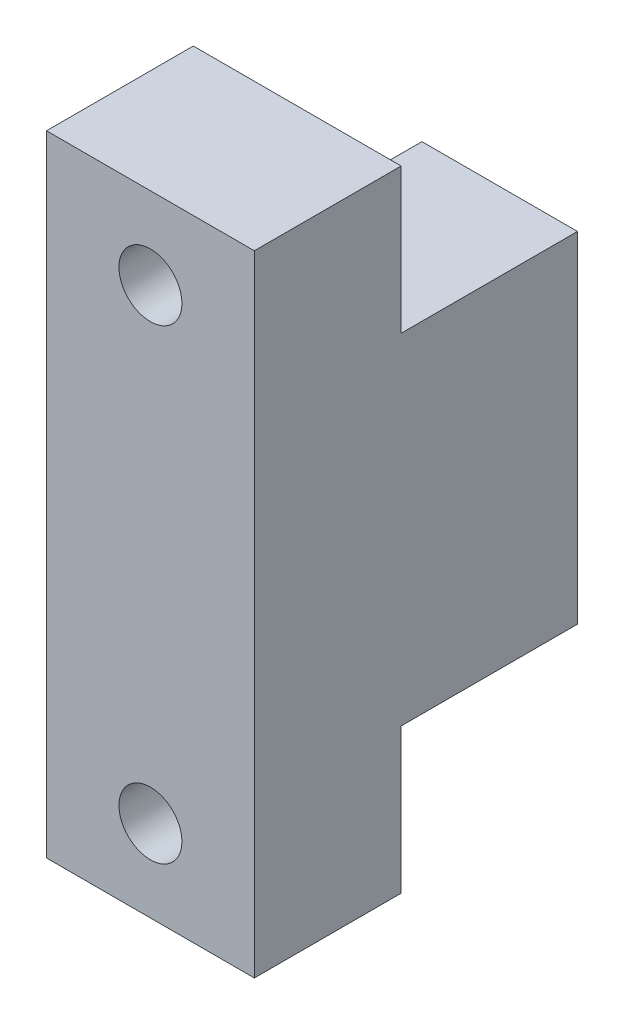
ISO-10303-21;
HEADER;
FILE_DESCRIPTION(('STEP AP214'),'2;1');
FILE_NAME('part.step','',(''),(''),'','','');
FILE_SCHEMA(('AUTOMOTIVE_DESIGN { 1 0 10303 214 1 1 1 1 }'));
ENDSEC;
DATA;
#1=APPLICATION_CONTEXT('core data for automotive mechanical design processes');
#2=APPLICATION_PROTOCOL_DEFINITION('international standard','automotive_design',2000,#1);
#3=PRODUCT_CONTEXT('',#1,'mechanical');
#4=PRODUCT('Part','Part','',(#3));
#5=PRODUCT_RELATED_PRODUCT_CATEGORY('part','',(#4));
#6=PRODUCT_DEFINITION_FORMATION('','',#4);
#7=PRODUCT_DEFINITION_CONTEXT('part definition',#1,'design');
#8=PRODUCT_DEFINITION('design','',#6,#7);
#9=PRODUCT_DEFINITION_SHAPE('','',#8);
#10=(LENGTH_UNIT() NAMED_UNIT(*) SI_UNIT(.MILLI.,.METRE.));
#11=(NAMED_UNIT(*) PLANE_ANGLE_UNIT() SI_UNIT($,.RADIAN.));
#12=(NAMED_UNIT(*) SI_UNIT($,.STERADIAN.) SOLID_ANGLE_UNIT());
#13=UNCERTAINTY_MEASURE_WITH_UNIT(LENGTH_MEASURE(1.E-05),#10,'distance_accuracy_value','');
#14=(GEOMETRIC_REPRESENTATION_CONTEXT(3) GLOBAL_UNCERTAINTY_ASSIGNED_CONTEXT((#13)) GLOBAL_UNIT_ASSIGNED_CONTEXT((#10,
#11,#12)) REPRESENTATION_CONTEXT('',''));
#15=CARTESIAN_POINT('',(0.,0.,0.));
#16=DIRECTION('',(0.,0.,1.));
#17=DIRECTION('',(1.,0.,0.));
#18=AXIS2_PLACEMENT_3D('',#15,#16,#17);
#19=CARTESIAN_POINT('',(-2.60427187106552,9.90671661729943,-5.99999999999804));
#20=DIRECTION('',(0.,0.,1.));
#21=DIRECTION('',(-1.,0.,0.));
#22=AXIS2_PLACEMENT_3D('',#19,#20,#21);
#23=PLANE('',#22);
#24=CARTESIAN_POINT('',(-2.72378881314441,17.9067153880362,-5.99999999999806));
#25=DIRECTION('',(0.,0.,1.));
#26=DIRECTION('',(1.,0.,0.));
#27=AXIS2_PLACEMENT_3D('',#24,#25,#26);
#28=CIRCLE('',#27,3.1);
#29=CARTESIAN_POINT('',(0.376211186855589,17.9067153880362,-5.99999999999808));
#30=VERTEX_POINT('',#29);
#31=EDGE_CURVE('E344',#30,#30,#28,.T.);
#32=ORIENTED_EDGE('',*,*,#31,.T.);
#33=EDGE_LOOP('',(#32));
#34=FACE_BOUND('',#33,.T.);
#35=CARTESIAN_POINT('',(-2.72378881314433,1.90671538803624,-5.99999999999801));
#36=DIRECTION('',(0.,0.,1.));
#37=DIRECTION('',(1.,0.,0.));
#38=AXIS2_PLACEMENT_3D('',#35,#36,#37);
#39=CIRCLE('',#38,3.1);
#40=CARTESIAN_POINT('',(0.376211186855676,1.90671538803624,-5.99999999999803));
#41=VERTEX_POINT('',#40);
#42=EDGE_CURVE('E51',#41,#41,#39,.T.);
#43=ORIENTED_EDGE('',*,*,#42,.T.);
#44=EDGE_LOOP('',(#43));
#45=FACE_BOUND('',#44,.T.);
#46=DIRECTION('',(-1.,0.,0.));
#47=VECTOR('',#46,1.);
#48=CARTESIAN_POINT('',(-2.72378881314444,21.8067153880362,-5.99999999999807));
#49=LINE('',#48,#47);
#50=CARTESIAN_POINT('',(-2.72378881314444,21.8067153880362,-5.99999999999807));
#51=VERTEX_POINT('',#50);
#52=CARTESIAN_POINT('',(-6.82378881314439,21.8067153880362,-5.99999999999805));
#53=VERTEX_POINT('',#52);
#54=EDGE_CURVE('E58',#51,#53,#49,.T.);
#55=ORIENTED_EDGE('',*,*,#54,.F.);
#56=CARTESIAN_POINT('',(-2.72378881314442,17.9067153880362,-5.99999999999806));
#57=DIRECTION('',(0.,0.,1.));
#58=DIRECTION('',(-1.,0.,0.));
#59=AXIS2_PLACEMENT_3D('',#56,#57,#58);
#60=CIRCLE('',#59,3.9);
#61=CARTESIAN_POINT('',(1.17621118685558,17.9067153880363,-5.99999999999809));
#62=VERTEX_POINT('',#61);
#63=EDGE_CURVE('E62',#62,#51,#60,.T.);
#64=ORIENTED_EDGE('',*,*,#63,.F.);
#65=DIRECTION('',(0.,1.,0.));
#66=VECTOR('',#65,1.);
#67=CARTESIAN_POINT('',(1.17621118685566,1.90671538803626,-5.99999999999804));
#68=LINE('',#67,#66);
#69=CARTESIAN_POINT('',(1.17621118685566,1.90671538803626,-5.99999999999804));
#70=VERTEX_POINT('',#69);
#71=EDGE_CURVE('E208',#70,#62,#68,.T.);
#72=ORIENTED_EDGE('',*,*,#71,.F.);
#73=CARTESIAN_POINT('',(-2.72378881314434,1.90671538803624,-5.99999999999801));
#74=DIRECTION('',(0.,0.,1.));
#75=DIRECTION('',(-1.,0.,0.));
#76=AXIS2_PLACEMENT_3D('',#73,#74,#75);
#77=CIRCLE('',#76,3.9);
#78=CARTESIAN_POINT('',(-2.72378881314431,-1.99328461196376,-5.999999999998));
#79=VERTEX_POINT('',#78);
#80=EDGE_CURVE('E204',#79,#70,#77,.T.);
#81=ORIENTED_EDGE('',*,*,#80,.F.);
#82=DIRECTION('',(1.,0.,0.));
#83=VECTOR('',#82,1.);
#84=CARTESIAN_POINT('',(-6.82378881314428,-1.99328461196379,-5.99999999999797));
#85=LINE('',#84,#83);
#86=CARTESIAN_POINT('',(-6.82378881314428,-1.99328461196378,-5.99999999999797));
#87=VERTEX_POINT('',#86);
#88=EDGE_CURVE('E200',#87,#79,#85,.T.);
#89=ORIENTED_EDGE('',*,*,#88,.F.);
#90=DIRECTION('',(0.,-1.,0.));
#91=VECTOR('',#90,1.);
#92=CARTESIAN_POINT('',(-6.82378881314427,-3.59328461196373,-5.99999999999797));
#93=LINE('',#92,#91);
#94=EDGE_CURVE('E245',#53,#87,#93,.T.);
#95=ORIENTED_EDGE('',*,*,#94,.F.);
#96=EDGE_LOOP('',(#55,#64,#72,#81,#89,#95));
#97=FACE_BOUND('',#96,.T.);
#98=ADVANCED_FACE('F41',(#34,#45,#97),#23,.F.);
#99=CARTESIAN_POINT('',(0.,0.,0.));
#100=DIRECTION('',(0.,0.,1.));
#101=DIRECTION('',(1.,0.,0.));
#102=AXIS2_PLACEMENT_3D('',#99,#100,#101);
#103=PLANE('',#102);
#104=CARTESIAN_POINT('',(-2.72378881314441,28.4067153880389,0.));
#105=DIRECTION('',(0.,0.,1.));
#106=DIRECTION('',(1.,0.,0.));
#107=AXIS2_PLACEMENT_3D('',#104,#105,#106);
#108=CIRCLE('',#107,4.5);
#109=CARTESIAN_POINT('',(1.77621118685559,28.4067153880389,0.));
#110=VERTEX_POINT('',#109);
#111=EDGE_CURVE('E334',#110,#110,#108,.T.);
#112=ORIENTED_EDGE('',*,*,#111,.T.);
#113=EDGE_LOOP('',(#112));
#114=FACE_BOUND('',#113,.T.);
#115=CARTESIAN_POINT('',(-2.72378881314433,-8.59328461196111,0.));
#116=DIRECTION('',(0.,0.,1.));
#117=DIRECTION('',(1.,0.,0.));
#118=AXIS2_PLACEMENT_3D('',#115,#116,#117);
#119=CIRCLE('',#118,4.5);
#120=CARTESIAN_POINT('',(1.77621118685567,-8.59328461196111,0.));
#121=VERTEX_POINT('',#120);
#122=EDGE_CURVE('E281',#121,#121,#119,.T.);
#123=ORIENTED_EDGE('',*,*,#122,.T.);
#124=EDGE_LOOP('',(#123));
#125=FACE_BOUND('',#124,.T.);
#126=DIRECTION('',(-1.,0.,0.));
#127=VECTOR('',#126,1.);
#128=CARTESIAN_POINT('',(-6.82378881314427,-3.59328461196382,0.));
#129=LINE('',#128,#127);
#130=CARTESIAN_POINT('',(5.52621118685907,-3.59328461196382,0.));
#131=VERTEX_POINT('',#130);
#132=CARTESIAN_POINT('',(-6.82378881314427,-3.59328461196382,0.));
#133=VERTEX_POINT('',#132);
#134=EDGE_CURVE('E258',#131,#133,#129,.T.);
#135=ORIENTED_EDGE('',*,*,#134,.F.);
#136=DIRECTION('',(0.,1.,0.));
#137=VECTOR('',#136,1.);
#138=CARTESIAN_POINT('',(5.52621118685907,-15.0932846119611,0.));
#139=LINE('',#138,#137);
#140=CARTESIAN_POINT('',(5.52621118685907,-15.0932846119611,0.));
#141=VERTEX_POINT('',#140);
#142=EDGE_CURVE('E151',#141,#131,#139,.T.);
#143=ORIENTED_EDGE('',*,*,#142,.F.);
#144=DIRECTION('',(1.,0.,0.));
#145=VECTOR('',#144,1.);
#146=CARTESIAN_POINT('',(-10.9737888131409,-15.0932846119611,0.));
#147=LINE('',#146,#145);
#148=CARTESIAN_POINT('',(-10.9737888131409,-15.0932846119611,0.));
#149=VERTEX_POINT('',#148);
#150=EDGE_CURVE('E304',#149,#141,#147,.T.);
#151=ORIENTED_EDGE('',*,*,#150,.F.);
#152=DIRECTION('',(0.,-1.,0.));
#153=VECTOR('',#152,1.);
#154=CARTESIAN_POINT('',(-10.9737888131409,34.9067153880389,0.));
#155=LINE('',#154,#153);
#156=CARTESIAN_POINT('',(-10.9737888131409,34.9067153880389,0.));
#157=VERTEX_POINT('',#156);
#158=EDGE_CURVE('E285',#157,#149,#155,.T.);
#159=ORIENTED_EDGE('',*,*,#158,.F.);
#160=DIRECTION('',(-1.,0.,0.));
#161=VECTOR('',#160,1.);
#162=CARTESIAN_POINT('',(-10.9737888131409,34.9067153880389,0.));
#163=LINE('',#162,#161);
#164=CARTESIAN_POINT('',(5.52621118685907,34.9067153880389,0.));
#165=VERTEX_POINT('',#164);
#166=EDGE_CURVE('E291',#165,#157,#163,.T.);
#167=ORIENTED_EDGE('',*,*,#166,.F.);
#168=CARTESIAN_POINT('',(5.52621118685907,23.4067153880362,0.));
#169=VERTEX_POINT('',#168);
#170=EDGE_CURVE('E307',#169,#165,#139,.T.);
#171=ORIENTED_EDGE('',*,*,#170,.F.);
#172=DIRECTION('',(1.,0.,0.));
#173=VECTOR('',#172,1.);
#174=CARTESIAN_POINT('',(-6.82378881314439,23.4067153880362,0.));
#175=LINE('',#174,#173);
#176=CARTESIAN_POINT('',(-6.82378881314439,23.4067153880362,0.));
#177=VERTEX_POINT('',#176);
#178=EDGE_CURVE('E254',#177,#169,#175,.T.);
#179=ORIENTED_EDGE('',*,*,#178,.F.);
#180=DIRECTION('',(0.,1.,0.));
#181=VECTOR('',#180,1.);
#182=CARTESIAN_POINT('',(-6.82378881314427,-3.59328461196382,0.));
#183=LINE('',#182,#181);
#184=EDGE_CURVE('E241',#133,#177,#183,.T.);
#185=ORIENTED_EDGE('',*,*,#184,.F.);
#186=EDGE_LOOP('',(#135,#143,#151,#159,#167,#171,#179,#185));
#187=FACE_BOUND('',#186,.T.);
#188=ADVANCED_FACE('F375',(#114,#125,#187),#103,.F.);
#189=CARTESIAN_POINT('',(0.,0.,11.655));
#190=DIRECTION('',(0.,0.,1.));
#191=DIRECTION('',(1.,0.,0.));
#192=AXIS2_PLACEMENT_3D('',#189,#190,#191);
#193=PLANE('',#192);
#194=CARTESIAN_POINT('',(-2.72378881314433,-8.59328461196111,11.655));
#195=DIRECTION('',(0.,0.,1.));
#196=DIRECTION('',(1.,0.,0.));
#197=AXIS2_PLACEMENT_3D('',#194,#195,#196);
#198=CIRCLE('',#197,2.5);
#199=CARTESIAN_POINT('',(-0.223788813144326,-8.59328461196111,11.655));
#200=VERTEX_POINT('',#199);
#201=EDGE_CURVE('E280',#200,#200,#198,.T.);
#202=ORIENTED_EDGE('',*,*,#201,.F.);
#203=EDGE_LOOP('',(#202));
#204=FACE_BOUND('',#203,.T.);
#205=DIRECTION('',(0.,-1.,0.));
#206=VECTOR('',#205,1.);
#207=CARTESIAN_POINT('',(-10.9737888131409,34.9067153880389,11.655));
#208=LINE('',#207,#206);
#209=CARTESIAN_POINT('',(-10.9737888131409,34.9067153880389,11.655));
#210=VERTEX_POINT('',#209);
#211=CARTESIAN_POINT('',(-10.9737888131409,-15.0932846119611,11.655));
#212=VERTEX_POINT('',#211);
#213=EDGE_CURVE('E286',#210,#212,#208,.T.);
#214=ORIENTED_EDGE('',*,*,#213,.T.);
#215=DIRECTION('',(1.,0.,0.));
#216=VECTOR('',#215,1.);
#217=CARTESIAN_POINT('',(-10.9737888131409,-15.0932846119611,11.655));
#218=LINE('',#217,#216);
#219=CARTESIAN_POINT('',(5.52621118685907,-15.0932846119611,11.655));
#220=VERTEX_POINT('',#219);
#221=EDGE_CURVE('E290',#212,#220,#218,.T.);
#222=ORIENTED_EDGE('',*,*,#221,.T.);
#223=DIRECTION('',(0.,1.,0.));
#224=VECTOR('',#223,1.);
#225=CARTESIAN_POINT('',(5.52621118685907,-15.0932846119611,11.655));
#226=LINE('',#225,#224);
#227=CARTESIAN_POINT('',(5.52621118685907,34.9067153880389,11.655));
#228=VERTEX_POINT('',#227);
#229=EDGE_CURVE('E294',#220,#228,#226,.T.);
#230=ORIENTED_EDGE('',*,*,#229,.T.);
#231=DIRECTION('',(-1.,0.,0.));
#232=VECTOR('',#231,1.);
#233=CARTESIAN_POINT('',(-10.9737888131409,34.9067153880389,11.655));
#234=LINE('',#233,#232);
#235=EDGE_CURVE('E297',#228,#210,#234,.T.);
#236=ORIENTED_EDGE('',*,*,#235,.T.);
#237=EDGE_LOOP('',(#214,#222,#230,#236));
#238=FACE_BOUND('',#237,.T.);
#239=CARTESIAN_POINT('',(-2.72378881314441,28.4067153880389,11.655));
#240=DIRECTION('',(0.,0.,1.));
#241=DIRECTION('',(1.,0.,0.));
#242=AXIS2_PLACEMENT_3D('',#239,#240,#241);
#243=CIRCLE('',#242,2.5);
#244=CARTESIAN_POINT('',(-0.223788813144407,28.4067153880389,11.655));
#245=VERTEX_POINT('',#244);
#246=EDGE_CURVE('E276',#245,#245,#243,.T.);
#247=ORIENTED_EDGE('',*,*,#246,.F.);
#248=EDGE_LOOP('',(#247));
#249=FACE_BOUND('',#248,.T.);
#250=ADVANCED_FACE('F381',(#204,#238,#249),#193,.T.);
#251=CARTESIAN_POINT('',(-10.9737888131409,34.9067153880389,11.655));
#252=DIRECTION('',(1.,0.,0.));
#253=DIRECTION('',(0.,0.,-1.));
#254=AXIS2_PLACEMENT_3D('',#251,#252,#253);
#255=PLANE('',#254);
#256=ORIENTED_EDGE('',*,*,#158,.T.);
#257=DIRECTION('',(0.,0.,-1.));
#258=VECTOR('',#257,1.);
#259=CARTESIAN_POINT('',(-10.9737888131409,-15.0932846119611,11.655));
#260=LINE('',#259,#258);
#261=EDGE_CURVE('E322',#212,#149,#260,.T.);
#262=ORIENTED_EDGE('',*,*,#261,.F.);
#263=ORIENTED_EDGE('',*,*,#213,.F.);
#264=DIRECTION('',(0.,0.,-1.));
#265=VECTOR('',#264,1.);
#266=CARTESIAN_POINT('',(-10.9737888131409,34.9067153880389,11.655));
#267=LINE('',#266,#265);
#268=EDGE_CURVE('E300',#210,#157,#267,.T.);
#269=ORIENTED_EDGE('',*,*,#268,.T.);
#270=EDGE_LOOP('',(#256,#262,#263,#269));
#271=FACE_BOUND('',#270,.T.);
#272=ADVANCED_FACE('F420',(#271),#255,.F.);
#273=CARTESIAN_POINT('',(-10.9737888131409,-15.0932846119611,11.655));
#274=DIRECTION('',(0.,1.,0.));
#275=DIRECTION('',(0.,0.,1.));
#276=AXIS2_PLACEMENT_3D('',#273,#274,#275);
#277=PLANE('',#276);
#278=ORIENTED_EDGE('',*,*,#150,.T.);
#279=DIRECTION('',(0.,0.,-1.));
#280=VECTOR('',#279,1.);
#281=CARTESIAN_POINT('',(5.52621118685907,-15.0932846119611,11.655));
#282=LINE('',#281,#280);
#283=EDGE_CURVE('E319',#220,#141,#282,.T.);
#284=ORIENTED_EDGE('',*,*,#283,.F.);
#285=ORIENTED_EDGE('',*,*,#221,.F.);
#286=ORIENTED_EDGE('',*,*,#261,.T.);
#287=EDGE_LOOP('',(#278,#284,#285,#286));
#288=FACE_BOUND('',#287,.T.);
#289=ADVANCED_FACE('F428',(#288),#277,.F.);
#290=CARTESIAN_POINT('',(5.52621118685907,-15.0932846119611,11.655));
#291=DIRECTION('',(-1.,0.,0.));
#292=DIRECTION('',(0.,0.,1.));
#293=AXIS2_PLACEMENT_3D('',#290,#291,#292);
#294=PLANE('',#293);
#295=ORIENTED_EDGE('',*,*,#142,.T.);
#296=DIRECTION('',(0.,0.,1.));
#297=VECTOR('',#296,1.);
#298=CARTESIAN_POINT('',(5.52621118685907,-3.59328461196382,-35.6904445908102));
#299=LINE('',#298,#297);
#300=CARTESIAN_POINT('',(5.52621118685901,-3.59328461196385,-13.9999999999981));
#301=VERTEX_POINT('',#300);
#302=EDGE_CURVE('E143',#301,#131,#299,.T.);
#303=ORIENTED_EDGE('',*,*,#302,.F.);
#304=DIRECTION('',(0.,-1.,0.));
#305=VECTOR('',#304,1.);
#306=CARTESIAN_POINT('',(5.52621118685901,23.4067153880361,-13.9999999999981));
#307=LINE('',#306,#305);
#308=CARTESIAN_POINT('',(5.52621118685901,23.4067153880361,-13.9999999999981));
#309=VERTEX_POINT('',#308);
#310=EDGE_CURVE('E148',#309,#301,#307,.T.);
#311=ORIENTED_EDGE('',*,*,#310,.F.);
#312=DIRECTION('',(0.,0.,1.));
#313=VECTOR('',#312,1.);
#314=CARTESIAN_POINT('',(5.52621118685907,23.4067153880362,-35.6904445908102));
#315=LINE('',#314,#313);
#316=EDGE_CURVE('E155',#309,#169,#315,.T.);
#317=ORIENTED_EDGE('',*,*,#316,.T.);
#318=ORIENTED_EDGE('',*,*,#170,.T.);
#319=DIRECTION('',(0.,0.,-1.));
#320=VECTOR('',#319,1.);
#321=CARTESIAN_POINT('',(5.52621118685907,34.9067153880389,11.655));
#322=LINE('',#321,#320);
#323=EDGE_CURVE('E315',#228,#165,#322,.T.);
#324=ORIENTED_EDGE('',*,*,#323,.F.);
#325=ORIENTED_EDGE('',*,*,#229,.F.);
#326=ORIENTED_EDGE('',*,*,#283,.T.);
#327=EDGE_LOOP('',(#295,#303,#311,#317,#318,#324,#325,#326));
#328=FACE_BOUND('',#327,.T.);
#329=ADVANCED_FACE('F145',(#328),#294,.F.);
#330=CARTESIAN_POINT('',(-10.9737888131409,34.9067153880389,11.655));
#331=DIRECTION('',(0.,-1.,0.));
#332=DIRECTION('',(0.,0.,-1.));
#333=AXIS2_PLACEMENT_3D('',#330,#331,#332);
#334=PLANE('',#333);
#335=ORIENTED_EDGE('',*,*,#166,.T.);
#336=ORIENTED_EDGE('',*,*,#268,.F.);
#337=ORIENTED_EDGE('',*,*,#235,.F.);
#338=ORIENTED_EDGE('',*,*,#323,.T.);
#339=EDGE_LOOP('',(#335,#336,#337,#338));
#340=FACE_BOUND('',#339,.T.);
#341=ADVANCED_FACE('F417',(#340),#334,.F.);
#342=CARTESIAN_POINT('',(-2.72378881314433,-8.59328461196111,11.655));
#343=DIRECTION('',(0.,0.,-1.));
#344=DIRECTION('',(-1.,0.,0.));
#345=AXIS2_PLACEMENT_3D('',#342,#343,#344);
#346=CYLINDRICAL_SURFACE('',#345,2.5);
#347=CARTESIAN_POINT('',(-2.72378881314433,-8.59328461196111,4.655));
#348=DIRECTION('',(0.,0.,1.));
#349=DIRECTION('',(1.,0.,0.));
#350=AXIS2_PLACEMENT_3D('',#347,#348,#349);
#351=CIRCLE('',#350,2.5);
#352=CARTESIAN_POINT('',(-0.223788813144326,-8.59328461196111,4.655));
#353=VERTEX_POINT('',#352);
#354=EDGE_CURVE('E330',#353,#353,#351,.T.);
#355=ORIENTED_EDGE('',*,*,#354,.F.);
#356=EDGE_LOOP('',(#355));
#357=FACE_BOUND('',#356,.T.);
#358=ORIENTED_EDGE('',*,*,#201,.T.);
#359=EDGE_LOOP('',(#358));
#360=FACE_BOUND('',#359,.T.);
#361=ADVANCED_FACE('F413',(#357,#360),#346,.F.);
#362=CARTESIAN_POINT('',(-2.72378881314441,28.4067153880389,11.655));
#363=DIRECTION('',(0.,0.,-1.));
#364=DIRECTION('',(-1.,0.,0.));
#365=AXIS2_PLACEMENT_3D('',#362,#363,#364);
#366=CYLINDRICAL_SURFACE('',#365,2.5);
#367=CARTESIAN_POINT('',(-2.72378881314441,28.4067153880389,4.655));
#368=DIRECTION('',(0.,0.,1.));
#369=DIRECTION('',(1.,0.,0.));
#370=AXIS2_PLACEMENT_3D('',#367,#368,#369);
#371=CIRCLE('',#370,2.5);
#372=CARTESIAN_POINT('',(-0.223788813144407,28.4067153880389,4.655));
#373=VERTEX_POINT('',#372);
#374=EDGE_CURVE('E272',#373,#373,#371,.T.);
#375=ORIENTED_EDGE('',*,*,#374,.F.);
#376=EDGE_LOOP('',(#375));
#377=FACE_BOUND('',#376,.T.);
#378=ORIENTED_EDGE('',*,*,#246,.T.);
#379=EDGE_LOOP('',(#378));
#380=FACE_BOUND('',#379,.T.);
#381=ADVANCED_FACE('F409',(#377,#380),#366,.F.);
#382=CARTESIAN_POINT('',(-2.72378881314441,28.4067153880389,-5.345));
#383=DIRECTION('',(0.,0.,1.));
#384=DIRECTION('',(1.,0.,0.));
#385=AXIS2_PLACEMENT_3D('',#382,#383,#384);
#386=CYLINDRICAL_SURFACE('',#385,4.5);
#387=CARTESIAN_POINT('',(-2.72378881314441,28.4067153880389,4.655));
#388=DIRECTION('',(0.,0.,1.));
#389=DIRECTION('',(1.,0.,0.));
#390=AXIS2_PLACEMENT_3D('',#387,#388,#389);
#391=CIRCLE('',#390,4.5);
#392=CARTESIAN_POINT('',(1.77621118685559,28.4067153880389,4.655));
#393=VERTEX_POINT('',#392);
#394=EDGE_CURVE('E249',#393,#393,#391,.T.);
#395=ORIENTED_EDGE('',*,*,#394,.T.);
#396=EDGE_LOOP('',(#395));
#397=FACE_BOUND('',#396,.T.);
#398=ORIENTED_EDGE('',*,*,#111,.F.);
#399=EDGE_LOOP('',(#398));
#400=FACE_BOUND('',#399,.T.);
#401=ADVANCED_FACE('F405',(#397,#400),#386,.F.);
#402=CARTESIAN_POINT('',(-2.72378881314441,28.4067153880389,4.655));
#403=DIRECTION('',(0.,0.,1.));
#404=DIRECTION('',(1.,0.,0.));
#405=AXIS2_PLACEMENT_3D('',#402,#403,#404);
#406=PLANE('',#405);
#407=ORIENTED_EDGE('',*,*,#374,.T.);
#408=EDGE_LOOP('',(#407));
#409=FACE_BOUND('',#408,.T.);
#410=ORIENTED_EDGE('',*,*,#394,.F.);
#411=EDGE_LOOP('',(#410));
#412=FACE_BOUND('',#411,.T.);
#413=ADVANCED_FACE('F401',(#409,#412),#406,.F.);
#414=CARTESIAN_POINT('',(-2.72378881314433,-8.59328461196111,-5.345));
#415=DIRECTION('',(0.,0.,1.));
#416=DIRECTION('',(1.,0.,0.));
#417=AXIS2_PLACEMENT_3D('',#414,#415,#416);
#418=CYLINDRICAL_SURFACE('',#417,4.5);
#419=CARTESIAN_POINT('',(-2.72378881314433,-8.59328461196111,4.655));
#420=DIRECTION('',(0.,0.,1.));
#421=DIRECTION('',(1.,0.,0.));
#422=AXIS2_PLACEMENT_3D('',#419,#420,#421);
#423=CIRCLE('',#422,4.5);
#424=CARTESIAN_POINT('',(1.77621118685567,-8.59328461196111,4.655));
#425=VERTEX_POINT('',#424);
#426=EDGE_CURVE('E268',#425,#425,#423,.T.);
#427=ORIENTED_EDGE('',*,*,#426,.T.);
#428=EDGE_LOOP('',(#427));
#429=FACE_BOUND('',#428,.T.);
#430=ORIENTED_EDGE('',*,*,#122,.F.);
#431=EDGE_LOOP('',(#430));
#432=FACE_BOUND('',#431,.T.);
#433=ADVANCED_FACE('F397',(#429,#432),#418,.F.);
#434=CARTESIAN_POINT('',(-2.72378881314433,-8.59328461196111,4.655));
#435=DIRECTION('',(0.,0.,1.));
#436=DIRECTION('',(1.,0.,0.));
#437=AXIS2_PLACEMENT_3D('',#434,#435,#436);
#438=PLANE('',#437);
#439=ORIENTED_EDGE('',*,*,#354,.T.);
#440=EDGE_LOOP('',(#439));
#441=FACE_BOUND('',#440,.T.);
#442=ORIENTED_EDGE('',*,*,#426,.F.);
#443=EDGE_LOOP('',(#442));
#444=FACE_BOUND('',#443,.T.);
#445=ADVANCED_FACE('F388',(#441,#444),#438,.F.);
#446=CARTESIAN_POINT('',(-6.82378881314427,-3.59328461196382,-35.6904445908102));
#447=DIRECTION('',(0.,1.,0.));
#448=DIRECTION('',(0.,0.,1.));
#449=AXIS2_PLACEMENT_3D('',#446,#447,#448);
#450=PLANE('',#449);
#451=DIRECTION('',(0.,0.,1.));
#452=VECTOR('',#451,1.);
#453=CARTESIAN_POINT('',(-6.82378881314427,-3.59328461196382,-35.6904445908102));
#454=LINE('',#453,#452);
#455=CARTESIAN_POINT('',(-6.82378881314433,-3.59328461196385,-13.999999999998));
#456=VERTEX_POINT('',#455);
#457=EDGE_CURVE('E156',#456,#133,#454,.T.);
#458=ORIENTED_EDGE('',*,*,#457,.F.);
#459=DIRECTION('',(-1.,0.,0.));
#460=VECTOR('',#459,1.);
#461=CARTESIAN_POINT('',(5.52621118685901,-3.59328461196385,-13.9999999999981));
#462=LINE('',#461,#460);
#463=EDGE_CURVE('E159',#301,#456,#462,.T.);
#464=ORIENTED_EDGE('',*,*,#463,.F.);
#465=ORIENTED_EDGE('',*,*,#302,.T.);
#466=ORIENTED_EDGE('',*,*,#134,.T.);
#467=EDGE_LOOP('',(#458,#464,#465,#466));
#468=FACE_BOUND('',#467,.T.);
#469=ADVANCED_FACE('F160',(#468),#450,.F.);
#470=CARTESIAN_POINT('',(-6.82378881314439,23.4067153880362,-35.6904445908102));
#471=DIRECTION('',(0.,-1.,0.));
#472=DIRECTION('',(0.,0.,-1.));
#473=AXIS2_PLACEMENT_3D('',#470,#471,#472);
#474=PLANE('',#473);
#475=ORIENTED_EDGE('',*,*,#316,.F.);
#476=DIRECTION('',(1.,0.,0.));
#477=VECTOR('',#476,1.);
#478=CARTESIAN_POINT('',(-6.82378881314445,23.4067153880361,-13.999999999998));
#479=LINE('',#478,#477);
#480=CARTESIAN_POINT('',(-6.82378881314445,23.4067153880361,-13.999999999998));
#481=VERTEX_POINT('',#480);
#482=EDGE_CURVE('E171',#481,#309,#479,.T.);
#483=ORIENTED_EDGE('',*,*,#482,.F.);
#484=DIRECTION('',(0.,0.,1.));
#485=VECTOR('',#484,1.);
#486=CARTESIAN_POINT('',(-6.82378881314439,23.4067153880362,-35.6904445908102));
#487=LINE('',#486,#485);
#488=EDGE_CURVE('E250',#481,#177,#487,.T.);
#489=ORIENTED_EDGE('',*,*,#488,.T.);
#490=ORIENTED_EDGE('',*,*,#178,.T.);
#491=EDGE_LOOP('',(#475,#483,#489,#490));
#492=FACE_BOUND('',#491,.T.);
#493=ADVANCED_FACE('F387',(#492),#474,.F.);
#494=CARTESIAN_POINT('',(-6.82378881314427,-3.59328461196382,-35.6904445908102));
#495=DIRECTION('',(1.,0.,0.));
#496=DIRECTION('',(0.,1.,0.));
#497=AXIS2_PLACEMENT_3D('',#494,#495,#496);
#498=PLANE('',#497);
#499=ORIENTED_EDGE('',*,*,#488,.F.);
#500=DIRECTION('',(0.,1.,0.));
#501=VECTOR('',#500,1.);
#502=CARTESIAN_POINT('',(-6.82378881314444,21.8067153880362,-13.999999999998));
#503=LINE('',#502,#501);
#504=CARTESIAN_POINT('',(-6.82378881314444,21.8067153880362,-13.999999999998));
#505=VERTEX_POINT('',#504);
#506=EDGE_CURVE('E194',#505,#481,#503,.T.);
#507=ORIENTED_EDGE('',*,*,#506,.F.);
#508=DIRECTION('',(0.,0.,1.));
#509=VECTOR('',#508,1.);
#510=CARTESIAN_POINT('',(-6.82378881314444,21.8067153880362,-13.999999999998));
#511=LINE('',#510,#509);
#512=EDGE_CURVE('E199',#505,#53,#511,.T.);
#513=ORIENTED_EDGE('',*,*,#512,.T.);
#514=ORIENTED_EDGE('',*,*,#94,.T.);
#515=DIRECTION('',(0.,0.,1.));
#516=VECTOR('',#515,1.);
#517=CARTESIAN_POINT('',(-6.82378881314433,-1.99328461196381,-13.999999999998));
#518=LINE('',#517,#516);
#519=CARTESIAN_POINT('',(-6.82378881314433,-1.99328461196381,-13.999999999998));
#520=VERTEX_POINT('',#519);
#521=EDGE_CURVE('E232',#520,#87,#518,.T.);
#522=ORIENTED_EDGE('',*,*,#521,.F.);
#523=DIRECTION('',(0.,1.,0.));
#524=VECTOR('',#523,1.);
#525=CARTESIAN_POINT('',(-6.82378881314433,-3.59328461196385,-13.999999999998));
#526=LINE('',#525,#524);
#527=EDGE_CURVE('E165',#456,#520,#526,.T.);
#528=ORIENTED_EDGE('',*,*,#527,.F.);
#529=ORIENTED_EDGE('',*,*,#457,.T.);
#530=ORIENTED_EDGE('',*,*,#184,.T.);
#531=EDGE_LOOP('',(#499,#507,#513,#514,#522,#528,#529,#530));
#532=FACE_BOUND('',#531,.T.);
#533=ADVANCED_FACE('F362',(#532),#498,.F.);
#534=CARTESIAN_POINT('',(-2.72378881314429,1.90671538803626,1.98712574173143E-12));
#535=DIRECTION('',(0.,0.,-1.));
#536=DIRECTION('',(-1.,0.,0.));
#537=AXIS2_PLACEMENT_3D('',#534,#535,#536);
#538=CYLINDRICAL_SURFACE('',#537,2.1);
#539=CARTESIAN_POINT('',(-2.72378881314432,1.90671538803624,-4.99999999999801));
#540=DIRECTION('',(0.,0.,1.));
#541=DIRECTION('',(1.,0.,0.));
#542=AXIS2_PLACEMENT_3D('',#539,#540,#541);
#543=CIRCLE('',#542,2.1);
#544=CARTESIAN_POINT('',(-0.623788813144321,1.90671538803624,-4.99999999999802));
#545=VERTEX_POINT('',#544);
#546=EDGE_CURVE('E326',#545,#545,#543,.F.);
#547=ORIENTED_EDGE('',*,*,#546,.T.);
#548=EDGE_LOOP('',(#547));
#549=FACE_BOUND('',#548,.T.);
#550=CARTESIAN_POINT('',(-2.72378881314429,1.90671538803626,1.98712574173143E-12));
#551=DIRECTION('',(0.,0.,-1.));
#552=DIRECTION('',(-1.,0.,0.));
#553=AXIS2_PLACEMENT_3D('',#550,#551,#552);
#554=CIRCLE('',#553,2.1);
#555=CARTESIAN_POINT('',(-4.82378881314429,1.90671538803626,2.0020734602438E-12));
#556=VERTEX_POINT('',#555);
#557=EDGE_CURVE('E236',#556,#556,#554,.T.);
#558=ORIENTED_EDGE('',*,*,#557,.F.);
#559=EDGE_LOOP('',(#558));
#560=FACE_BOUND('',#559,.T.);
#561=ADVANCED_FACE('F358',(#549,#560),#538,.F.);
#562=CARTESIAN_POINT('',(-2.72378881314429,1.90671538803626,1.98712574173143E-12));
#563=DIRECTION('',(0.,0.,-1.));
#564=DIRECTION('',(-1.,0.,0.));
#565=AXIS2_PLACEMENT_3D('',#562,#563,#564);
#566=PLANE('',#565);
#567=ORIENTED_EDGE('',*,*,#557,.T.);
#568=EDGE_LOOP('',(#567));
#569=FACE_BOUND('',#568,.T.);
#570=ADVANCED_FACE('F361',(#569),#566,.T.);
#571=CARTESIAN_POINT('',(-2.72378881314437,17.9067153880363,1.93855348440408E-12));
#572=DIRECTION('',(0.,0.,-1.));
#573=DIRECTION('',(-1.,0.,0.));
#574=AXIS2_PLACEMENT_3D('',#571,#572,#573);
#575=CYLINDRICAL_SURFACE('',#574,2.1);
#576=CARTESIAN_POINT('',(-2.7237888131444,17.9067153880362,-4.99999999999806));
#577=DIRECTION('',(0.,0.,1.));
#578=DIRECTION('',(1.,0.,0.));
#579=AXIS2_PLACEMENT_3D('',#576,#577,#578);
#580=CIRCLE('',#579,2.1);
#581=CARTESIAN_POINT('',(-0.623788813144401,17.9067153880362,-4.99999999999808));
#582=VERTEX_POINT('',#581);
#583=EDGE_CURVE('E11',#582,#582,#580,.F.);
#584=ORIENTED_EDGE('',*,*,#583,.T.);
#585=EDGE_LOOP('',(#584));
#586=FACE_BOUND('',#585,.T.);
#587=CARTESIAN_POINT('',(-2.72378881314437,17.9067153880363,1.93855348440408E-12));
#588=DIRECTION('',(0.,0.,-1.));
#589=DIRECTION('',(-1.,0.,0.));
#590=AXIS2_PLACEMENT_3D('',#587,#588,#589);
#591=CIRCLE('',#590,2.1);
#592=CARTESIAN_POINT('',(-4.82378881314436,17.9067153880363,1.95350120291645E-12));
#593=VERTEX_POINT('',#592);
#594=EDGE_CURVE('E237',#593,#593,#591,.T.);
#595=ORIENTED_EDGE('',*,*,#594,.F.);
#596=EDGE_LOOP('',(#595));
#597=FACE_BOUND('',#596,.T.);
#598=ADVANCED_FACE('F367',(#586,#597),#575,.F.);
#599=CARTESIAN_POINT('',(-2.72378881314437,17.9067153880363,1.93855348440408E-12));
#600=DIRECTION('',(0.,0.,-1.));
#601=DIRECTION('',(-1.,0.,0.));
#602=AXIS2_PLACEMENT_3D('',#599,#600,#601);
#603=PLANE('',#602);
#604=ORIENTED_EDGE('',*,*,#594,.T.);
#605=EDGE_LOOP('',(#604));
#606=FACE_BOUND('',#605,.T.);
#607=ADVANCED_FACE('F355',(#606),#603,.T.);
#608=CARTESIAN_POINT('',(-2.72378881314432,1.90671538803624,-4.99999999999801));
#609=DIRECTION('',(0.,0.,-1.));
#610=DIRECTION('',(-1.,0.,0.));
#611=AXIS2_PLACEMENT_3D('',#608,#609,#610);
#612=CONICAL_SURFACE('',#611,2.1,0.785398163397448);
#613=ORIENTED_EDGE('',*,*,#42,.F.);
#614=EDGE_LOOP('',(#613));
#615=FACE_BOUND('',#614,.T.);
#616=ORIENTED_EDGE('',*,*,#546,.F.);
#617=EDGE_LOOP('',(#616));
#618=FACE_BOUND('',#617,.T.);
#619=ADVANCED_FACE('F352',(#615,#618),#612,.F.);
#620=CARTESIAN_POINT('',(-2.7237888131444,17.9067153880362,-4.99999999999806));
#621=DIRECTION('',(0.,0.,-1.));
#622=DIRECTION('',(-1.,0.,0.));
#623=AXIS2_PLACEMENT_3D('',#620,#621,#622);
#624=CONICAL_SURFACE('',#623,2.1,0.785398163397447);
#625=ORIENTED_EDGE('',*,*,#31,.F.);
#626=EDGE_LOOP('',(#625));
#627=FACE_BOUND('',#626,.T.);
#628=ORIENTED_EDGE('',*,*,#583,.F.);
#629=EDGE_LOOP('',(#628));
#630=FACE_BOUND('',#629,.T.);
#631=ADVANCED_FACE('F44',(#627,#630),#624,.F.);
#632=CARTESIAN_POINT('',(-6.82378881314433,-1.99328461196381,-13.999999999998));
#633=DIRECTION('',(0.,-1.,0.));
#634=DIRECTION('',(1.,0.,0.));
#635=AXIS2_PLACEMENT_3D('',#632,#633,#634);
#636=PLANE('',#635);
#637=ORIENTED_EDGE('',*,*,#88,.T.);
#638=DIRECTION('',(0.,0.,1.));
#639=VECTOR('',#638,1.);
#640=CARTESIAN_POINT('',(-2.72378881314437,-1.99328461196378,-13.999999999998));
#641=LINE('',#640,#639);
#642=CARTESIAN_POINT('',(-2.72378881314437,-1.99328461196378,-13.999999999998));
#643=VERTEX_POINT('',#642);
#644=EDGE_CURVE('E228',#643,#79,#641,.T.);
#645=ORIENTED_EDGE('',*,*,#644,.F.);
#646=DIRECTION('',(1.,0.,0.));
#647=VECTOR('',#646,1.);
#648=CARTESIAN_POINT('',(-6.82378881314433,-1.99328461196381,-13.999999999998));
#649=LINE('',#648,#647);
#650=EDGE_CURVE('E179',#520,#643,#649,.T.);
#651=ORIENTED_EDGE('',*,*,#650,.F.);
#652=ORIENTED_EDGE('',*,*,#521,.T.);
#653=EDGE_LOOP('',(#637,#645,#651,#652));
#654=FACE_BOUND('',#653,.T.);
#655=ADVANCED_FACE('F461',(#654),#636,.F.);
#656=CARTESIAN_POINT('',(-2.72378881314439,1.90671538803622,-13.999999999998));
#657=DIRECTION('',(0.,0.,1.));
#658=DIRECTION('',(1.,0.,0.));
#659=AXIS2_PLACEMENT_3D('',#656,#657,#658);
#660=CYLINDRICAL_SURFACE('',#659,3.9);
#661=ORIENTED_EDGE('',*,*,#80,.T.);
#662=DIRECTION('',(0.,0.,1.));
#663=VECTOR('',#662,1.);
#664=CARTESIAN_POINT('',(1.17621118685561,1.90671538803623,-13.999999999998));
#665=LINE('',#664,#663);
#666=CARTESIAN_POINT('',(1.17621118685561,1.90671538803623,-13.999999999998));
#667=VERTEX_POINT('',#666);
#668=EDGE_CURVE('E224',#667,#70,#665,.T.);
#669=ORIENTED_EDGE('',*,*,#668,.F.);
#670=CARTESIAN_POINT('',(-2.72378881314439,1.90671538803622,-13.999999999998));
#671=DIRECTION('',(0.,0.,1.));
#672=DIRECTION('',(-1.,0.,0.));
#673=AXIS2_PLACEMENT_3D('',#670,#671,#672);
#674=CIRCLE('',#673,3.9);
#675=EDGE_CURVE('E182',#643,#667,#674,.T.);
#676=ORIENTED_EDGE('',*,*,#675,.F.);
#677=ORIENTED_EDGE('',*,*,#644,.T.);
#678=EDGE_LOOP('',(#661,#669,#676,#677));
#679=FACE_BOUND('',#678,.T.);
#680=ADVANCED_FACE('F463',(#679),#660,.F.);
#681=CARTESIAN_POINT('',(1.17621118685561,1.90671538803623,-13.999999999998));
#682=DIRECTION('',(1.,0.,0.));
#683=DIRECTION('',(0.,0.,-1.));
#684=AXIS2_PLACEMENT_3D('',#681,#682,#683);
#685=PLANE('',#684);
#686=ORIENTED_EDGE('',*,*,#71,.T.);
#687=DIRECTION('',(0.,0.,1.));
#688=VECTOR('',#687,1.);
#689=CARTESIAN_POINT('',(1.17621118685553,17.9067153880362,-13.9999999999981));
#690=LINE('',#689,#688);
#691=CARTESIAN_POINT('',(1.17621118685553,17.9067153880362,-13.9999999999981));
#692=VERTEX_POINT('',#691);
#693=EDGE_CURVE('E220',#692,#62,#690,.T.);
#694=ORIENTED_EDGE('',*,*,#693,.F.);
#695=DIRECTION('',(0.,1.,0.));
#696=VECTOR('',#695,1.);
#697=CARTESIAN_POINT('',(1.17621118685561,1.90671538803623,-13.999999999998));
#698=LINE('',#697,#696);
#699=EDGE_CURVE('E185',#667,#692,#698,.T.);
#700=ORIENTED_EDGE('',*,*,#699,.F.);
#701=ORIENTED_EDGE('',*,*,#668,.T.);
#702=EDGE_LOOP('',(#686,#694,#700,#701));
#703=FACE_BOUND('',#702,.T.);
#704=ADVANCED_FACE('F467',(#703),#685,.F.);
#705=CARTESIAN_POINT('',(-2.72378881314447,17.9067153880362,-13.9999999999981));
#706=DIRECTION('',(0.,0.,1.));
#707=DIRECTION('',(1.,0.,0.));
#708=AXIS2_PLACEMENT_3D('',#705,#706,#707);
#709=CYLINDRICAL_SURFACE('',#708,3.9);
#710=ORIENTED_EDGE('',*,*,#63,.T.);
#711=DIRECTION('',(0.,0.,1.));
#712=VECTOR('',#711,1.);
#713=CARTESIAN_POINT('',(-2.72378881314449,21.8067153880362,-13.9999999999981));
#714=LINE('',#713,#712);
#715=CARTESIAN_POINT('',(-2.72378881314449,21.8067153880362,-13.9999999999981));
#716=VERTEX_POINT('',#715);
#717=EDGE_CURVE('E216',#716,#51,#714,.T.);
#718=ORIENTED_EDGE('',*,*,#717,.F.);
#719=CARTESIAN_POINT('',(-2.72378881314447,17.9067153880362,-13.9999999999981));
#720=DIRECTION('',(0.,0.,1.));
#721=DIRECTION('',(-1.,0.,0.));
#722=AXIS2_PLACEMENT_3D('',#719,#720,#721);
#723=CIRCLE('',#722,3.9);
#724=EDGE_CURVE('E188',#692,#716,#723,.T.);
#725=ORIENTED_EDGE('',*,*,#724,.F.);
#726=ORIENTED_EDGE('',*,*,#693,.T.);
#727=EDGE_LOOP('',(#710,#718,#725,#726));
#728=FACE_BOUND('',#727,.T.);
#729=ADVANCED_FACE('F473',(#728),#709,.F.);
#730=CARTESIAN_POINT('',(-2.72378881314449,21.8067153880362,-13.9999999999981));
#731=DIRECTION('',(0.,1.,0.));
#732=DIRECTION('',(0.,0.,1.));
#733=AXIS2_PLACEMENT_3D('',#730,#731,#732);
#734=PLANE('',#733);
#735=ORIENTED_EDGE('',*,*,#54,.T.);
#736=ORIENTED_EDGE('',*,*,#512,.F.);
#737=DIRECTION('',(-1.,0.,0.));
#738=VECTOR('',#737,1.);
#739=CARTESIAN_POINT('',(-2.72378881314449,21.8067153880362,-13.9999999999981));
#740=LINE('',#739,#738);
#741=EDGE_CURVE('E191',#716,#505,#740,.T.);
#742=ORIENTED_EDGE('',*,*,#741,.F.);
#743=ORIENTED_EDGE('',*,*,#717,.T.);
#744=EDGE_LOOP('',(#735,#736,#742,#743));
#745=FACE_BOUND('',#744,.T.);
#746=ADVANCED_FACE('F475',(#745),#734,.F.);
#747=CARTESIAN_POINT('',(-2.72378881314439,1.90671538803622,-13.999999999998));
#748=DIRECTION('',(0.,0.,-1.));
#749=DIRECTION('',(-1.,0.,0.));
#750=AXIS2_PLACEMENT_3D('',#747,#748,#749);
#751=PLANE('',#750);
#752=ORIENTED_EDGE('',*,*,#310,.T.);
#753=ORIENTED_EDGE('',*,*,#463,.T.);
#754=ORIENTED_EDGE('',*,*,#527,.T.);
#755=ORIENTED_EDGE('',*,*,#650,.T.);
#756=ORIENTED_EDGE('',*,*,#675,.T.);
#757=ORIENTED_EDGE('',*,*,#699,.T.);
#758=ORIENTED_EDGE('',*,*,#724,.T.);
#759=ORIENTED_EDGE('',*,*,#741,.T.);
#760=ORIENTED_EDGE('',*,*,#506,.T.);
#761=ORIENTED_EDGE('',*,*,#482,.T.);
#762=EDGE_LOOP('',(#752,#753,#754,#755,#756,#757,#758,#759,#760,#761));
#763=FACE_BOUND('',#762,.T.);
#764=ADVANCED_FACE('F168',(#763),#751,.T.);
#765=CLOSED_SHELL('',(#98,#188,#250,#272,#289,#329,#341,#361,#381,#401,#413,#433,#445,#469,#493,
#533,#561,#570,#598,#607,#619,#631,#655,#680,#704,#729,#746,#764));
#766=MANIFOLD_SOLID_BREP('B2',#765);
#767=ADVANCED_BREP_SHAPE_REPRESENTATION('',(#18,#766),#14);
#768=SHAPE_DEFINITION_REPRESENTATION(#9,#767);
ENDSEC;
END-ISO-10303-21;
